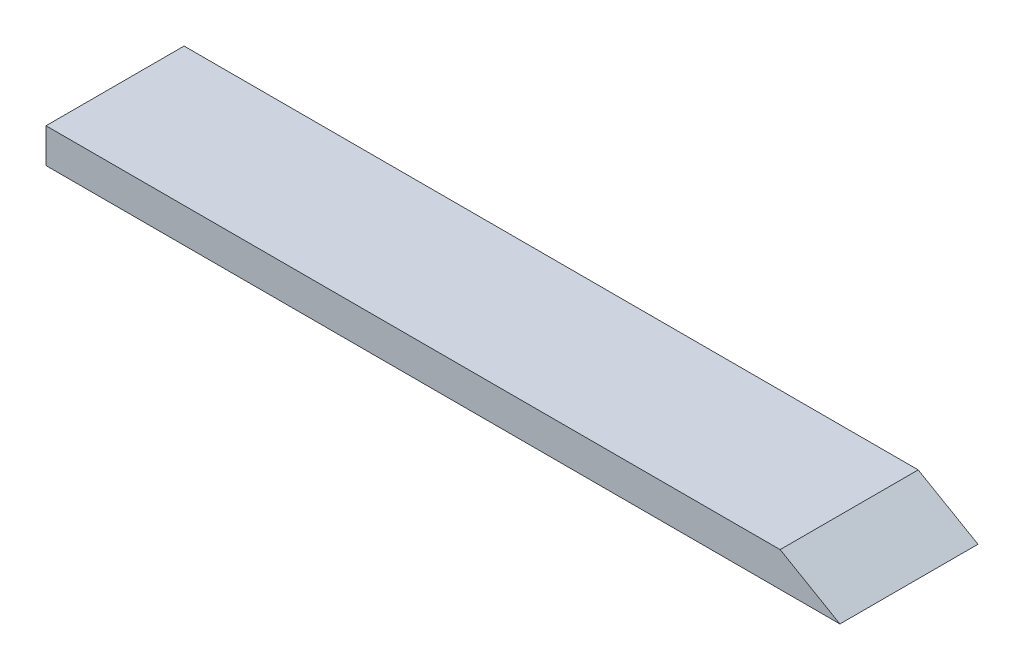
ISO-10303-21;
HEADER;
FILE_DESCRIPTION(('STEP AP214'),'2;1');
FILE_NAME('part.step','',(''),(''),'','','');
FILE_SCHEMA(('AUTOMOTIVE_DESIGN { 1 0 10303 214 1 1 1 1 }'));
ENDSEC;
DATA;
#1=APPLICATION_CONTEXT('core data for automotive mechanical design processes');
#2=APPLICATION_PROTOCOL_DEFINITION('international standard','automotive_design',2000,#1);
#3=PRODUCT_CONTEXT('',#1,'mechanical');
#4=PRODUCT('Part','Part','',(#3));
#5=PRODUCT_RELATED_PRODUCT_CATEGORY('part','',(#4));
#6=PRODUCT_DEFINITION_FORMATION('','',#4);
#7=PRODUCT_DEFINITION_CONTEXT('part definition',#1,'design');
#8=PRODUCT_DEFINITION('design','',#6,#7);
#9=PRODUCT_DEFINITION_SHAPE('','',#8);
#10=(LENGTH_UNIT() NAMED_UNIT(*) SI_UNIT(.MILLI.,.METRE.));
#11=(NAMED_UNIT(*) PLANE_ANGLE_UNIT() SI_UNIT($,.RADIAN.));
#12=(NAMED_UNIT(*) SI_UNIT($,.STERADIAN.) SOLID_ANGLE_UNIT());
#13=UNCERTAINTY_MEASURE_WITH_UNIT(LENGTH_MEASURE(1.E-05),#10,'distance_accuracy_value','');
#14=(GEOMETRIC_REPRESENTATION_CONTEXT(3) GLOBAL_UNCERTAINTY_ASSIGNED_CONTEXT((#13)) GLOBAL_UNIT_ASSIGNED_CONTEXT((#10,
#11,#12)) REPRESENTATION_CONTEXT('',''));
#15=CARTESIAN_POINT('',(0.,0.,0.));
#16=DIRECTION('',(0.,0.,1.));
#17=DIRECTION('',(1.,0.,0.));
#18=AXIS2_PLACEMENT_3D('',#15,#16,#17);
#19=CARTESIAN_POINT('',(-57.5,5.,-10.));
#20=DIRECTION('',(0.,0.,1.));
#21=DIRECTION('',(1.,0.,0.));
#22=AXIS2_PLACEMENT_3D('',#19,#20,#21);
#23=PLANE('',#22);
#24=DIRECTION('',(-1.,0.,0.));
#25=VECTOR('',#24,1.);
#26=CARTESIAN_POINT('',(-57.5,5.,-10.));
#27=LINE('',#26,#25);
#28=CARTESIAN_POINT('',(48.8397459621555,5.,-10.));
#29=VERTEX_POINT('',#28);
#30=CARTESIAN_POINT('',(-57.5,5.,-10.));
#31=VERTEX_POINT('',#30);
#32=EDGE_CURVE('E86',#29,#31,#27,.T.);
#33=ORIENTED_EDGE('',*,*,#32,.F.);
#34=DIRECTION('',(0.866025403784441,-0.499999999999995,0.));
#35=VECTOR('',#34,1.);
#36=CARTESIAN_POINT('',(57.5,0.,-10.));
#37=LINE('',#36,#35);
#38=CARTESIAN_POINT('',(57.5,0.,-10.));
#39=VERTEX_POINT('',#38);
#40=EDGE_CURVE('E80',#29,#39,#37,.T.);
#41=ORIENTED_EDGE('',*,*,#40,.T.);
#42=DIRECTION('',(-1.,0.,0.));
#43=VECTOR('',#42,1.);
#44=CARTESIAN_POINT('',(-57.5,0.,-10.));
#45=LINE('',#44,#43);
#46=CARTESIAN_POINT('',(-57.5,0.,-10.));
#47=VERTEX_POINT('',#46);
#48=EDGE_CURVE('E90',#39,#47,#45,.T.);
#49=ORIENTED_EDGE('',*,*,#48,.T.);
#50=DIRECTION('',(0.,-1.,0.));
#51=VECTOR('',#50,1.);
#52=CARTESIAN_POINT('',(-57.5,5.,-10.));
#53=LINE('',#52,#51);
#54=EDGE_CURVE('E11',#31,#47,#53,.T.);
#55=ORIENTED_EDGE('',*,*,#54,.F.);
#56=EDGE_LOOP('',(#33,#41,#49,#55));
#57=FACE_BOUND('',#56,.T.);
#58=ADVANCED_FACE('F33',(#57),#23,.F.);
#59=CARTESIAN_POINT('',(-57.5,5.,10.));
#60=DIRECTION('',(1.,0.,0.));
#61=DIRECTION('',(0.,0.,-1.));
#62=AXIS2_PLACEMENT_3D('',#59,#60,#61);
#63=PLANE('',#62);
#64=DIRECTION('',(0.,0.,1.));
#65=VECTOR('',#64,1.);
#66=CARTESIAN_POINT('',(-57.5,0.,10.));
#67=LINE('',#66,#65);
#68=CARTESIAN_POINT('',(-57.5,0.,10.));
#69=VERTEX_POINT('',#68);
#70=EDGE_CURVE('E61',#47,#69,#67,.T.);
#71=ORIENTED_EDGE('',*,*,#70,.T.);
#72=DIRECTION('',(0.,-1.,0.));
#73=VECTOR('',#72,1.);
#74=CARTESIAN_POINT('',(-57.5,5.,10.));
#75=LINE('',#74,#73);
#76=CARTESIAN_POINT('',(-57.5,5.,10.));
#77=VERTEX_POINT('',#76);
#78=EDGE_CURVE('E41',#77,#69,#75,.T.);
#79=ORIENTED_EDGE('',*,*,#78,.F.);
#80=DIRECTION('',(0.,0.,1.));
#81=VECTOR('',#80,1.);
#82=CARTESIAN_POINT('',(-57.5,5.,10.));
#83=LINE('',#82,#81);
#84=EDGE_CURVE('E49',#31,#77,#83,.T.);
#85=ORIENTED_EDGE('',*,*,#84,.F.);
#86=ORIENTED_EDGE('',*,*,#54,.T.);
#87=EDGE_LOOP('',(#71,#79,#85,#86));
#88=FACE_BOUND('',#87,.T.);
#89=ADVANCED_FACE('F107',(#88),#63,.F.);
#90=CARTESIAN_POINT('',(-57.5,5.,10.));
#91=DIRECTION('',(0.,0.,-1.));
#92=DIRECTION('',(-1.,0.,0.));
#93=AXIS2_PLACEMENT_3D('',#90,#91,#92);
#94=PLANE('',#93);
#95=DIRECTION('',(1.,0.,0.));
#96=VECTOR('',#95,1.);
#97=CARTESIAN_POINT('',(-57.5,0.,10.));
#98=LINE('',#97,#96);
#99=CARTESIAN_POINT('',(57.5,0.,10.));
#100=VERTEX_POINT('',#99);
#101=EDGE_CURVE('E83',#69,#100,#98,.T.);
#102=ORIENTED_EDGE('',*,*,#101,.T.);
#103=DIRECTION('',(0.866025403784441,-0.499999999999995,0.));
#104=VECTOR('',#103,1.);
#105=CARTESIAN_POINT('',(57.5,0.,10.));
#106=LINE('',#105,#104);
#107=CARTESIAN_POINT('',(48.8397459621555,5.,10.));
#108=VERTEX_POINT('',#107);
#109=EDGE_CURVE('E68',#108,#100,#106,.T.);
#110=ORIENTED_EDGE('',*,*,#109,.F.);
#111=DIRECTION('',(1.,0.,0.));
#112=VECTOR('',#111,1.);
#113=CARTESIAN_POINT('',(-57.5,5.,10.));
#114=LINE('',#113,#112);
#115=EDGE_CURVE('E95',#77,#108,#114,.T.);
#116=ORIENTED_EDGE('',*,*,#115,.F.);
#117=ORIENTED_EDGE('',*,*,#78,.T.);
#118=EDGE_LOOP('',(#102,#110,#116,#117));
#119=FACE_BOUND('',#118,.T.);
#120=ADVANCED_FACE('F84',(#119),#94,.F.);
#121=CARTESIAN_POINT('',(0.,5.,0.));
#122=DIRECTION('',(0.,-1.,0.));
#123=DIRECTION('',(0.,0.,-1.));
#124=AXIS2_PLACEMENT_3D('',#121,#122,#123);
#125=PLANE('',#124);
#126=ORIENTED_EDGE('',*,*,#115,.T.);
#127=DIRECTION('',(0.,0.,1.));
#128=VECTOR('',#127,1.);
#129=CARTESIAN_POINT('',(48.8397459621555,5.,-10.));
#130=LINE('',#129,#128);
#131=EDGE_CURVE('E77',#29,#108,#130,.T.);
#132=ORIENTED_EDGE('',*,*,#131,.F.);
#133=ORIENTED_EDGE('',*,*,#32,.T.);
#134=ORIENTED_EDGE('',*,*,#84,.T.);
#135=EDGE_LOOP('',(#126,#132,#133,#134));
#136=FACE_BOUND('',#135,.T.);
#137=ADVANCED_FACE('F106',(#136),#125,.F.);
#138=CARTESIAN_POINT('',(0.,0.,0.));
#139=DIRECTION('',(0.,-1.,0.));
#140=DIRECTION('',(0.,0.,-1.));
#141=AXIS2_PLACEMENT_3D('',#138,#139,#140);
#142=PLANE('',#141);
#143=DIRECTION('',(0.,0.,-1.));
#144=VECTOR('',#143,1.);
#145=CARTESIAN_POINT('',(57.5,0.,10.));
#146=LINE('',#145,#144);
#147=EDGE_CURVE('E73',#100,#39,#146,.T.);
#148=ORIENTED_EDGE('',*,*,#147,.F.);
#149=ORIENTED_EDGE('',*,*,#101,.F.);
#150=ORIENTED_EDGE('',*,*,#70,.F.);
#151=ORIENTED_EDGE('',*,*,#48,.F.);
#152=EDGE_LOOP('',(#148,#149,#150,#151));
#153=FACE_BOUND('',#152,.T.);
#154=ADVANCED_FACE('F89',(#153),#142,.T.);
#155=CARTESIAN_POINT('',(57.5,0.,-10.));
#156=DIRECTION('',(-0.499999999999995,-0.866025403784441,0.));
#157=DIRECTION('',(0.866025403784441,-0.499999999999995,0.));
#158=AXIS2_PLACEMENT_3D('',#155,#156,#157);
#159=PLANE('',#158);
#160=ORIENTED_EDGE('',*,*,#109,.T.);
#161=ORIENTED_EDGE('',*,*,#147,.T.);
#162=ORIENTED_EDGE('',*,*,#40,.F.);
#163=ORIENTED_EDGE('',*,*,#131,.T.);
#164=EDGE_LOOP('',(#160,#161,#162,#163));
#165=FACE_BOUND('',#164,.T.);
#166=ADVANCED_FACE('F70',(#165),#159,.F.);
#167=CLOSED_SHELL('',(#58,#89,#120,#137,#154,#166));
#168=MANIFOLD_SOLID_BREP('B2',#167);
#169=ADVANCED_BREP_SHAPE_REPRESENTATION('',(#18,#168),#14);
#170=SHAPE_DEFINITION_REPRESENTATION(#9,#169);
ENDSEC;
END-ISO-10303-21;
